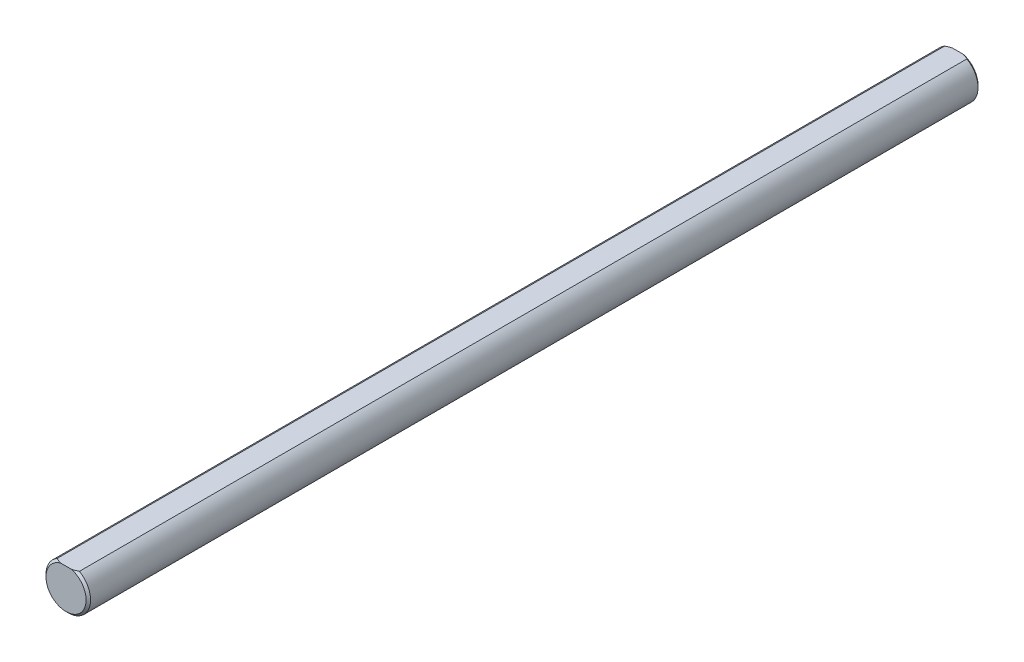
ISO-10303-21;
HEADER;
FILE_DESCRIPTION(('STEP AP214'),'2;1');
FILE_NAME('part.step','',(''),(''),'','','');
FILE_SCHEMA(('AUTOMOTIVE_DESIGN { 1 0 10303 214 1 1 1 1 }'));
ENDSEC;
DATA;
#1=APPLICATION_CONTEXT('core data for automotive mechanical design processes');
#2=APPLICATION_PROTOCOL_DEFINITION('international standard','automotive_design',2000,#1);
#3=PRODUCT_CONTEXT('',#1,'mechanical');
#4=PRODUCT('Part','Part','',(#3));
#5=PRODUCT_RELATED_PRODUCT_CATEGORY('part','',(#4));
#6=PRODUCT_DEFINITION_FORMATION('','',#4);
#7=PRODUCT_DEFINITION_CONTEXT('part definition',#1,'design');
#8=PRODUCT_DEFINITION('design','',#6,#7);
#9=PRODUCT_DEFINITION_SHAPE('','',#8);
#10=(LENGTH_UNIT() NAMED_UNIT(*) SI_UNIT(.MILLI.,.METRE.));
#11=(NAMED_UNIT(*) PLANE_ANGLE_UNIT() SI_UNIT($,.RADIAN.));
#12=(NAMED_UNIT(*) SI_UNIT($,.STERADIAN.) SOLID_ANGLE_UNIT());
#13=UNCERTAINTY_MEASURE_WITH_UNIT(LENGTH_MEASURE(1.E-05),#10,'distance_accuracy_value','');
#14=(GEOMETRIC_REPRESENTATION_CONTEXT(3) GLOBAL_UNCERTAINTY_ASSIGNED_CONTEXT((#13)) GLOBAL_UNIT_ASSIGNED_CONTEXT((#10,
#11,#12)) REPRESENTATION_CONTEXT('',''));
#15=CARTESIAN_POINT('',(0.,0.,0.));
#16=DIRECTION('',(0.,0.,1.));
#17=DIRECTION('',(1.,0.,0.));
#18=AXIS2_PLACEMENT_3D('',#15,#16,#17);
#19=CARTESIAN_POINT('',(0.,0.,100.));
#20=DIRECTION('',(0.,0.,-1.));
#21=DIRECTION('',(-1.,0.,0.));
#22=AXIS2_PLACEMENT_3D('',#19,#20,#21);
#23=CYLINDRICAL_SURFACE('',#22,5.);
#24=DIRECTION('',(0.,0.,1.));
#25=VECTOR('',#24,1.);
#26=CARTESIAN_POINT('',(-2.5,4.33012701892219,-100.));
#27=LINE('',#26,#25);
#28=CARTESIAN_POINT('',(-2.5,4.33012701892219,-99.5));
#29=VERTEX_POINT('',#28);
#30=CARTESIAN_POINT('',(-2.5,4.33012701892219,99.5));
#31=VERTEX_POINT('',#30);
#32=EDGE_CURVE('E79',#29,#31,#27,.T.);
#33=ORIENTED_EDGE('',*,*,#32,.F.);
#34=CARTESIAN_POINT('',(0.,0.,-99.5));
#35=DIRECTION('',(0.,0.,1.));
#36=DIRECTION('',(1.,0.,0.));
#37=AXIS2_PLACEMENT_3D('',#34,#35,#36);
#38=CIRCLE('',#37,5.);
#39=CARTESIAN_POINT('',(2.5,4.33012701892219,-99.5));
#40=VERTEX_POINT('',#39);
#41=EDGE_CURVE('E90',#29,#40,#38,.T.);
#42=ORIENTED_EDGE('',*,*,#41,.T.);
#43=DIRECTION('',(0.,0.,1.));
#44=VECTOR('',#43,1.);
#45=CARTESIAN_POINT('',(2.5,4.33012701892219,-100.));
#46=LINE('',#45,#44);
#47=CARTESIAN_POINT('',(2.5,4.33012701892219,99.5));
#48=VERTEX_POINT('',#47);
#49=EDGE_CURVE('E92',#40,#48,#46,.T.);
#50=ORIENTED_EDGE('',*,*,#49,.T.);
#51=CARTESIAN_POINT('',(0.,0.,99.5));
#52=DIRECTION('',(0.,0.,1.));
#53=DIRECTION('',(1.,0.,0.));
#54=AXIS2_PLACEMENT_3D('',#51,#52,#53);
#55=CIRCLE('',#54,5.);
#56=EDGE_CURVE('E91',#48,#31,#55,.F.);
#57=ORIENTED_EDGE('',*,*,#56,.T.);
#58=EDGE_LOOP('',(#33,#42,#50,#57));
#59=FACE_BOUND('',#58,.T.);
#60=ADVANCED_FACE('F32',(#59),#23,.T.);
#61=CARTESIAN_POINT('',(0.,0.,100.));
#62=DIRECTION('',(0.,0.,1.));
#63=DIRECTION('',(1.,0.,0.));
#64=AXIS2_PLACEMENT_3D('',#61,#62,#63);
#65=PLANE('',#64);
#66=DIRECTION('',(1.,0.,0.));
#67=VECTOR('',#66,1.);
#68=CARTESIAN_POINT('',(-2.5,4.33012701892219,100.));
#69=LINE('',#68,#67);
#70=CARTESIAN_POINT('',(-1.2247448713915,4.33012701892219,100.));
#71=VERTEX_POINT('',#70);
#72=CARTESIAN_POINT('',(1.2247448713915,4.33012701892219,100.));
#73=VERTEX_POINT('',#72);
#74=EDGE_CURVE('E133',#71,#73,#69,.T.);
#75=ORIENTED_EDGE('',*,*,#74,.F.);
#76=CARTESIAN_POINT('',(0.,0.,100.));
#77=DIRECTION('',(0.,0.,1.));
#78=DIRECTION('',(1.,0.,0.));
#79=AXIS2_PLACEMENT_3D('',#76,#77,#78);
#80=CIRCLE('',#79,4.49999999999998);
#81=EDGE_CURVE('E11',#71,#73,#80,.T.);
#82=ORIENTED_EDGE('',*,*,#81,.T.);
#83=EDGE_LOOP('',(#75,#82));
#84=FACE_BOUND('',#83,.T.);
#85=ADVANCED_FACE('F126',(#84),#65,.T.);
#86=CARTESIAN_POINT('',(0.,0.,-100.));
#87=DIRECTION('',(0.,0.,1.));
#88=DIRECTION('',(1.,0.,0.));
#89=AXIS2_PLACEMENT_3D('',#86,#87,#88);
#90=PLANE('',#89);
#91=DIRECTION('',(1.,0.,0.));
#92=VECTOR('',#91,1.);
#93=CARTESIAN_POINT('',(-2.5,4.33012701892219,-100.));
#94=LINE('',#93,#92);
#95=CARTESIAN_POINT('',(-1.2247448713915,4.33012701892219,-100.));
#96=VERTEX_POINT('',#95);
#97=CARTESIAN_POINT('',(1.2247448713915,4.33012701892219,-100.));
#98=VERTEX_POINT('',#97);
#99=EDGE_CURVE('E81',#96,#98,#94,.T.);
#100=ORIENTED_EDGE('',*,*,#99,.T.);
#101=CARTESIAN_POINT('',(0.,0.,-100.));
#102=DIRECTION('',(0.,0.,1.));
#103=DIRECTION('',(1.,0.,0.));
#104=AXIS2_PLACEMENT_3D('',#101,#102,#103);
#105=CIRCLE('',#104,4.49999999999998);
#106=EDGE_CURVE('E41',#98,#96,#105,.F.);
#107=ORIENTED_EDGE('',*,*,#106,.T.);
#108=EDGE_LOOP('',(#100,#107));
#109=FACE_BOUND('',#108,.T.);
#110=ADVANCED_FACE('F109',(#109),#90,.F.);
#111=CARTESIAN_POINT('',(-2.5,4.33012701892219,-100.));
#112=DIRECTION('',(0.,-1.,0.));
#113=DIRECTION('',(0.,0.,-1.));
#114=AXIS2_PLACEMENT_3D('',#111,#112,#113);
#115=PLANE('',#114);
#116=ORIENTED_EDGE('',*,*,#49,.F.);
#117=CARTESIAN_POINT('',(2.5,4.33012701892219,-99.5));
#118=CARTESIAN_POINT('',(2.39764593227196,4.33012701892219,-99.551162334614));
#119=CARTESIAN_POINT('',(2.29433367303982,4.33012701892219,-99.6004754450699));
#120=CARTESIAN_POINT('',(2.08595633192158,4.33012701892219,-99.6945288998822));
#121=CARTESIAN_POINT('',(1.98089612421624,4.33012701892219,-99.7392800740423));
#122=CARTESIAN_POINT('',(1.76864437799204,4.33012701892219,-99.8236094578022));
#123=CARTESIAN_POINT('',(1.66145195332557,4.33012701892219,-99.8631854625735));
#124=CARTESIAN_POINT('',(1.44475945950857,4.33012701892219,-99.936349914878));
#125=CARTESIAN_POINT('',(1.33525439885901,4.33012701892219,-99.9699235205208));
#126=CARTESIAN_POINT('',(1.2247448713915,4.33012701892219,-100.));
#127=B_SPLINE_CURVE_WITH_KNOTS('',3,(#117,#118,#119,#120,#121,#122,#123,#124,#125,#126),
.UNSPECIFIED.,.F.,.F.,(4,2,2,2,4),(0.,0.343311131933529,0.685787291176655,1.02840888681981,
1.37186629241042),.UNSPECIFIED.);
#128=EDGE_CURVE('E85',#40,#98,#127,.T.);
#129=ORIENTED_EDGE('',*,*,#128,.T.);
#130=ORIENTED_EDGE('',*,*,#99,.F.);
#131=CARTESIAN_POINT('',(-1.2247448713915,4.33012701892219,-100.));
#132=CARTESIAN_POINT('',(-1.33525439885901,4.33012701892219,-99.9699235205208));
#133=CARTESIAN_POINT('',(-1.44475945950857,4.33012701892219,-99.936349914878));
#134=CARTESIAN_POINT('',(-1.66145195332557,4.33012701892219,-99.8631854625735));
#135=CARTESIAN_POINT('',(-1.76864437799204,4.33012701892219,-99.8236094578022));
#136=CARTESIAN_POINT('',(-1.98089612421623,4.33012701892219,-99.7392800740423));
#137=CARTESIAN_POINT('',(-2.08595633192157,4.33012701892219,-99.6945288998822));
#138=CARTESIAN_POINT('',(-2.29433367303981,4.33012701892219,-99.6004754450699));
#139=CARTESIAN_POINT('',(-2.39764593227195,4.33012701892219,-99.551162334614));
#140=CARTESIAN_POINT('',(-2.5,4.33012701892219,-99.5));
#141=B_SPLINE_CURVE_WITH_KNOTS('',3,(#131,#132,#133,#134,#135,#136,#137,#138,#139,#140),
.UNSPECIFIED.,.F.,.F.,(4,2,2,2,4),(0.,0.343457405590602,0.68607900123376,1.02855516047688,
1.37186629241042),.UNSPECIFIED.);
#142=EDGE_CURVE('E75',#96,#29,#141,.T.);
#143=ORIENTED_EDGE('',*,*,#142,.T.);
#144=ORIENTED_EDGE('',*,*,#32,.T.);
#145=CARTESIAN_POINT('',(-2.5,4.33012701892219,99.5));
#146=CARTESIAN_POINT('',(-2.39764593227196,4.33012701892219,99.551162334614));
#147=CARTESIAN_POINT('',(-2.29433367303982,4.33012701892219,99.6004754450699));
#148=CARTESIAN_POINT('',(-2.08595633192158,4.33012701892219,99.6945288998822));
#149=CARTESIAN_POINT('',(-1.98089612421623,4.33012701892219,99.7392800740423));
#150=CARTESIAN_POINT('',(-1.76864437799204,4.33012701892219,99.8236094578022));
#151=CARTESIAN_POINT('',(-1.66145195332557,4.33012701892219,99.8631854625735));
#152=CARTESIAN_POINT('',(-1.44475945950857,4.33012701892219,99.936349914878));
#153=CARTESIAN_POINT('',(-1.33525439885901,4.33012701892219,99.9699235205208));
#154=CARTESIAN_POINT('',(-1.2247448713915,4.33012701892219,100.));
#155=B_SPLINE_CURVE_WITH_KNOTS('',3,(#145,#146,#147,#148,#149,#150,#151,#152,#153,#154),
.UNSPECIFIED.,.F.,.F.,(4,2,2,2,4),(0.,0.343311131933539,0.685787291176659,1.02840888681981,
1.37186629241042),.UNSPECIFIED.);
#156=EDGE_CURVE('E55',#31,#71,#155,.T.);
#157=ORIENTED_EDGE('',*,*,#156,.T.);
#158=ORIENTED_EDGE('',*,*,#74,.T.);
#159=CARTESIAN_POINT('',(1.2247448713915,4.33012701892219,100.));
#160=CARTESIAN_POINT('',(1.33525439885901,4.33012701892219,99.9699235205208));
#161=CARTESIAN_POINT('',(1.44475945950857,4.33012701892219,99.936349914878));
#162=CARTESIAN_POINT('',(1.66145195332557,4.33012701892219,99.8631854625735));
#163=CARTESIAN_POINT('',(1.76864437799204,4.33012701892219,99.8236094578022));
#164=CARTESIAN_POINT('',(1.98089612421623,4.33012701892219,99.7392800740423));
#165=CARTESIAN_POINT('',(2.08595633192158,4.33012701892219,99.6945288998822));
#166=CARTESIAN_POINT('',(2.29433367303982,4.33012701892219,99.6004754450699));
#167=CARTESIAN_POINT('',(2.39764593227196,4.33012701892219,99.551162334614));
#168=CARTESIAN_POINT('',(2.5,4.33012701892219,99.5));
#169=B_SPLINE_CURVE_WITH_KNOTS('',3,(#159,#160,#161,#162,#163,#164,#165,#166,#167,#168),
.UNSPECIFIED.,.F.,.F.,(4,2,2,2,4),(0.,0.343457405590606,0.686079001233762,1.02855516047689,
1.37186629241042),.UNSPECIFIED.);
#170=EDGE_CURVE('E48',#73,#48,#169,.T.);
#171=ORIENTED_EDGE('',*,*,#170,.T.);
#172=EDGE_LOOP('',(#116,#129,#130,#143,#144,#157,#158,#171));
#173=FACE_BOUND('',#172,.T.);
#174=ADVANCED_FACE('F78',(#173),#115,.F.);
#175=CARTESIAN_POINT('',(0.,0.,-99.5));
#176=DIRECTION('',(0.,0.,1.));
#177=DIRECTION('',(1.,0.,0.));
#178=AXIS2_PLACEMENT_3D('',#175,#176,#177);
#179=CONICAL_SURFACE('',#178,5.,0.785398163397472);
#180=ORIENTED_EDGE('',*,*,#142,.F.);
#181=ORIENTED_EDGE('',*,*,#106,.F.);
#182=ORIENTED_EDGE('',*,*,#128,.F.);
#183=ORIENTED_EDGE('',*,*,#41,.F.);
#184=EDGE_LOOP('',(#180,#181,#182,#183));
#185=FACE_BOUND('',#184,.T.);
#186=ADVANCED_FACE('F94',(#185),#179,.T.);
#187=CARTESIAN_POINT('',(0.,0.,100.));
#188=DIRECTION('',(0.,0.,-1.));
#189=DIRECTION('',(-1.,0.,0.));
#190=AXIS2_PLACEMENT_3D('',#187,#188,#189);
#191=CONICAL_SURFACE('',#190,4.49999999999998,0.785398163397458);
#192=ORIENTED_EDGE('',*,*,#156,.F.);
#193=ORIENTED_EDGE('',*,*,#56,.F.);
#194=ORIENTED_EDGE('',*,*,#170,.F.);
#195=ORIENTED_EDGE('',*,*,#81,.F.);
#196=EDGE_LOOP('',(#192,#193,#194,#195));
#197=FACE_BOUND('',#196,.T.);
#198=ADVANCED_FACE('F34',(#197),#191,.T.);
#199=CLOSED_SHELL('',(#60,#85,#110,#174,#186,#198));
#200=MANIFOLD_SOLID_BREP('B2',#199);
#201=ADVANCED_BREP_SHAPE_REPRESENTATION('',(#18,#200),#14);
#202=SHAPE_DEFINITION_REPRESENTATION(#9,#201);
ENDSEC;
END-ISO-10303-21;
